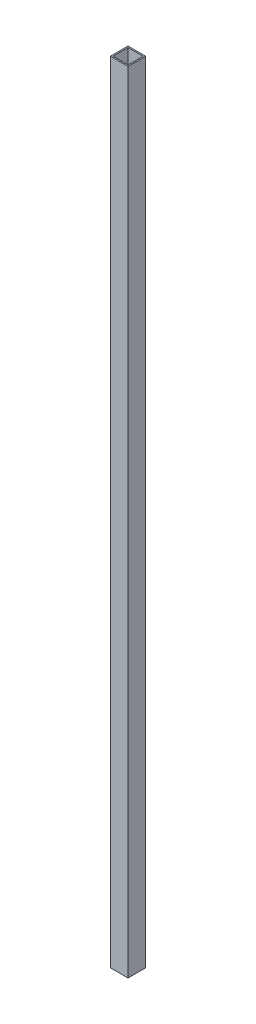
ISO-10303-21;
HEADER;
FILE_DESCRIPTION(('STEP AP214'),'2;1');
FILE_NAME('part.step','',(''),(''),'','','');
FILE_SCHEMA(('AUTOMOTIVE_DESIGN { 1 0 10303 214 1 1 1 1 }'));
ENDSEC;
DATA;
#1=APPLICATION_CONTEXT('core data for automotive mechanical design processes');
#2=APPLICATION_PROTOCOL_DEFINITION('international standard','automotive_design',2000,#1);
#3=PRODUCT_CONTEXT('',#1,'mechanical');
#4=PRODUCT('Part','Part','',(#3));
#5=PRODUCT_RELATED_PRODUCT_CATEGORY('part','',(#4));
#6=PRODUCT_DEFINITION_FORMATION('','',#4);
#7=PRODUCT_DEFINITION_CONTEXT('part definition',#1,'design');
#8=PRODUCT_DEFINITION('design','',#6,#7);
#9=PRODUCT_DEFINITION_SHAPE('','',#8);
#10=(LENGTH_UNIT() NAMED_UNIT(*) SI_UNIT(.MILLI.,.METRE.));
#11=(NAMED_UNIT(*) PLANE_ANGLE_UNIT() SI_UNIT($,.RADIAN.));
#12=(NAMED_UNIT(*) SI_UNIT($,.STERADIAN.) SOLID_ANGLE_UNIT());
#13=UNCERTAINTY_MEASURE_WITH_UNIT(LENGTH_MEASURE(1.E-05),#10,'distance_accuracy_value','');
#14=(GEOMETRIC_REPRESENTATION_CONTEXT(3) GLOBAL_UNCERTAINTY_ASSIGNED_CONTEXT((#13)) GLOBAL_UNIT_ASSIGNED_CONTEXT((#10,
#11,#12)) REPRESENTATION_CONTEXT('',''));
#15=CARTESIAN_POINT('',(0.,0.,0.));
#16=DIRECTION('',(0.,0.,1.));
#17=DIRECTION('',(1.,0.,0.));
#18=AXIS2_PLACEMENT_3D('',#15,#16,#17);
#19=CARTESIAN_POINT('',(0.,1985.9625,0.));
#20=DIRECTION('',(0.,-1.,0.));
#21=DIRECTION('',(0.,0.,-1.));
#22=AXIS2_PLACEMENT_3D('',#19,#20,#21);
#23=PLANE('',#22);
#24=DIRECTION('',(0.,0.,1.));
#25=VECTOR('',#24,1.);
#26=CARTESIAN_POINT('',(0.,1985.9625,0.));
#27=LINE('',#26,#25);
#28=CARTESIAN_POINT('',(0.,1985.9625,-44.45));
#29=VERTEX_POINT('',#28);
#30=CARTESIAN_POINT('',(0.,1985.9625,0.));
#31=VERTEX_POINT('',#30);
#32=EDGE_CURVE('E133',#29,#31,#27,.T.);
#33=ORIENTED_EDGE('',*,*,#32,.T.);
#34=DIRECTION('',(1.,0.,0.));
#35=VECTOR('',#34,1.);
#36=CARTESIAN_POINT('',(0.,1985.9625,0.));
#37=LINE('',#36,#35);
#38=CARTESIAN_POINT('',(44.45,1985.9625,0.));
#39=VERTEX_POINT('',#38);
#40=EDGE_CURVE('E136',#31,#39,#37,.T.);
#41=ORIENTED_EDGE('',*,*,#40,.T.);
#42=DIRECTION('',(0.,0.,-1.));
#43=VECTOR('',#42,1.);
#44=CARTESIAN_POINT('',(44.45,1985.9625,0.));
#45=LINE('',#44,#43);
#46=CARTESIAN_POINT('',(44.45,1985.9625,-44.45));
#47=VERTEX_POINT('',#46);
#48=EDGE_CURVE('E139',#39,#47,#45,.T.);
#49=ORIENTED_EDGE('',*,*,#48,.T.);
#50=DIRECTION('',(-1.,0.,0.));
#51=VECTOR('',#50,1.);
#52=CARTESIAN_POINT('',(0.,1985.9625,-44.45));
#53=LINE('',#52,#51);
#54=EDGE_CURVE('E141',#47,#29,#53,.T.);
#55=ORIENTED_EDGE('',*,*,#54,.T.);
#56=EDGE_LOOP('',(#33,#41,#49,#55));
#57=FACE_BOUND('',#56,.T.);
#58=DIRECTION('',(1.,0.,0.));
#59=VECTOR('',#58,1.);
#60=CARTESIAN_POINT('',(3.175,1985.9625,-3.175));
#61=LINE('',#60,#59);
#62=CARTESIAN_POINT('',(3.175,1985.9625,-3.175));
#63=VERTEX_POINT('',#62);
#64=CARTESIAN_POINT('',(41.275,1985.9625,-3.175));
#65=VERTEX_POINT('',#64);
#66=EDGE_CURVE('E97',#63,#65,#61,.T.);
#67=ORIENTED_EDGE('',*,*,#66,.F.);
#68=DIRECTION('',(0.,0.,1.));
#69=VECTOR('',#68,1.);
#70=CARTESIAN_POINT('',(3.175,1985.9625,-3.175));
#71=LINE('',#70,#69);
#72=CARTESIAN_POINT('',(3.175,1985.9625,-41.275));
#73=VERTEX_POINT('',#72);
#74=EDGE_CURVE('E119',#73,#63,#71,.T.);
#75=ORIENTED_EDGE('',*,*,#74,.F.);
#76=DIRECTION('',(-1.,0.,0.));
#77=VECTOR('',#76,1.);
#78=CARTESIAN_POINT('',(3.175,1985.9625,-41.275));
#79=LINE('',#78,#77);
#80=CARTESIAN_POINT('',(41.275,1985.9625,-41.275));
#81=VERTEX_POINT('',#80);
#82=EDGE_CURVE('E117',#81,#73,#79,.T.);
#83=ORIENTED_EDGE('',*,*,#82,.F.);
#84=DIRECTION('',(0.,0.,-1.));
#85=VECTOR('',#84,1.);
#86=CARTESIAN_POINT('',(41.275,1985.9625,-3.175));
#87=LINE('',#86,#85);
#88=EDGE_CURVE('E105',#65,#81,#87,.T.);
#89=ORIENTED_EDGE('',*,*,#88,.F.);
#90=EDGE_LOOP('',(#67,#75,#83,#89));
#91=FACE_BOUND('',#90,.T.);
#92=ADVANCED_FACE('F32',(#57,#91),#23,.F.);
#93=CARTESIAN_POINT('',(0.,0.,0.));
#94=DIRECTION('',(0.,-1.,0.));
#95=DIRECTION('',(0.,0.,-1.));
#96=AXIS2_PLACEMENT_3D('',#93,#94,#95);
#97=PLANE('',#96);
#98=DIRECTION('',(0.,0.,1.));
#99=VECTOR('',#98,1.);
#100=CARTESIAN_POINT('',(0.,0.,0.));
#101=LINE('',#100,#99);
#102=CARTESIAN_POINT('',(0.,0.,-44.45));
#103=VERTEX_POINT('',#102);
#104=CARTESIAN_POINT('',(0.,0.,0.));
#105=VERTEX_POINT('',#104);
#106=EDGE_CURVE('E113',#103,#105,#101,.T.);
#107=ORIENTED_EDGE('',*,*,#106,.F.);
#108=DIRECTION('',(-1.,0.,0.));
#109=VECTOR('',#108,1.);
#110=CARTESIAN_POINT('',(0.,0.,-44.45));
#111=LINE('',#110,#109);
#112=CARTESIAN_POINT('',(44.45,0.,-44.45));
#113=VERTEX_POINT('',#112);
#114=EDGE_CURVE('E137',#113,#103,#111,.T.);
#115=ORIENTED_EDGE('',*,*,#114,.F.);
#116=DIRECTION('',(0.,0.,-1.));
#117=VECTOR('',#116,1.);
#118=CARTESIAN_POINT('',(44.45,0.,0.));
#119=LINE('',#118,#117);
#120=CARTESIAN_POINT('',(44.45,0.,0.));
#121=VERTEX_POINT('',#120);
#122=EDGE_CURVE('E148',#121,#113,#119,.T.);
#123=ORIENTED_EDGE('',*,*,#122,.F.);
#124=DIRECTION('',(1.,0.,0.));
#125=VECTOR('',#124,1.);
#126=CARTESIAN_POINT('',(0.,0.,0.));
#127=LINE('',#126,#125);
#128=EDGE_CURVE('E146',#105,#121,#127,.T.);
#129=ORIENTED_EDGE('',*,*,#128,.F.);
#130=EDGE_LOOP('',(#107,#115,#123,#129));
#131=FACE_BOUND('',#130,.T.);
#132=DIRECTION('',(0.,0.,1.));
#133=VECTOR('',#132,1.);
#134=CARTESIAN_POINT('',(3.175,0.,-3.175));
#135=LINE('',#134,#133);
#136=CARTESIAN_POINT('',(3.175,0.,-41.275));
#137=VERTEX_POINT('',#136);
#138=CARTESIAN_POINT('',(3.175,0.,-3.175));
#139=VERTEX_POINT('',#138);
#140=EDGE_CURVE('E106',#137,#139,#135,.T.);
#141=ORIENTED_EDGE('',*,*,#140,.T.);
#142=DIRECTION('',(1.,0.,0.));
#143=VECTOR('',#142,1.);
#144=CARTESIAN_POINT('',(3.175,0.,-3.175));
#145=LINE('',#144,#143);
#146=CARTESIAN_POINT('',(41.275,0.,-3.175));
#147=VERTEX_POINT('',#146);
#148=EDGE_CURVE('E55',#139,#147,#145,.T.);
#149=ORIENTED_EDGE('',*,*,#148,.T.);
#150=DIRECTION('',(0.,0.,-1.));
#151=VECTOR('',#150,1.);
#152=CARTESIAN_POINT('',(41.275,0.,-3.175));
#153=LINE('',#152,#151);
#154=CARTESIAN_POINT('',(41.275,0.,-41.275));
#155=VERTEX_POINT('',#154);
#156=EDGE_CURVE('E112',#147,#155,#153,.T.);
#157=ORIENTED_EDGE('',*,*,#156,.T.);
#158=DIRECTION('',(-1.,0.,0.));
#159=VECTOR('',#158,1.);
#160=CARTESIAN_POINT('',(3.175,0.,-41.275));
#161=LINE('',#160,#159);
#162=EDGE_CURVE('E125',#155,#137,#161,.T.);
#163=ORIENTED_EDGE('',*,*,#162,.T.);
#164=EDGE_LOOP('',(#141,#149,#157,#163));
#165=FACE_BOUND('',#164,.T.);
#166=ADVANCED_FACE('F166',(#131,#165),#97,.T.);
#167=CARTESIAN_POINT('',(0.,1985.9625,0.));
#168=DIRECTION('',(1.,0.,0.));
#169=DIRECTION('',(0.,0.,-1.));
#170=AXIS2_PLACEMENT_3D('',#167,#168,#169);
#171=PLANE('',#170);
#172=ORIENTED_EDGE('',*,*,#106,.T.);
#173=DIRECTION('',(0.,-1.,0.));
#174=VECTOR('',#173,1.);
#175=CARTESIAN_POINT('',(0.,1985.9625,0.));
#176=LINE('',#175,#174);
#177=EDGE_CURVE('E11',#31,#105,#176,.T.);
#178=ORIENTED_EDGE('',*,*,#177,.F.);
#179=ORIENTED_EDGE('',*,*,#32,.F.);
#180=DIRECTION('',(0.,-1.,0.));
#181=VECTOR('',#180,1.);
#182=CARTESIAN_POINT('',(0.,1985.9625,-44.45));
#183=LINE('',#182,#181);
#184=EDGE_CURVE('E143',#29,#103,#183,.T.);
#185=ORIENTED_EDGE('',*,*,#184,.T.);
#186=EDGE_LOOP('',(#172,#178,#179,#185));
#187=FACE_BOUND('',#186,.T.);
#188=ADVANCED_FACE('F34',(#187),#171,.F.);
#189=CARTESIAN_POINT('',(0.,1985.9625,0.));
#190=DIRECTION('',(0.,0.,-1.));
#191=DIRECTION('',(-1.,0.,0.));
#192=AXIS2_PLACEMENT_3D('',#189,#190,#191);
#193=PLANE('',#192);
#194=ORIENTED_EDGE('',*,*,#128,.T.);
#195=DIRECTION('',(0.,-1.,0.));
#196=VECTOR('',#195,1.);
#197=CARTESIAN_POINT('',(44.45,1985.9625,0.));
#198=LINE('',#197,#196);
#199=EDGE_CURVE('E40',#39,#121,#198,.T.);
#200=ORIENTED_EDGE('',*,*,#199,.F.);
#201=ORIENTED_EDGE('',*,*,#40,.F.);
#202=ORIENTED_EDGE('',*,*,#177,.T.);
#203=EDGE_LOOP('',(#194,#200,#201,#202));
#204=FACE_BOUND('',#203,.T.);
#205=ADVANCED_FACE('F176',(#204),#193,.F.);
#206=CARTESIAN_POINT('',(44.45,1985.9625,0.));
#207=DIRECTION('',(-1.,0.,0.));
#208=DIRECTION('',(0.,0.,1.));
#209=AXIS2_PLACEMENT_3D('',#206,#207,#208);
#210=PLANE('',#209);
#211=ORIENTED_EDGE('',*,*,#122,.T.);
#212=DIRECTION('',(0.,-1.,0.));
#213=VECTOR('',#212,1.);
#214=CARTESIAN_POINT('',(44.45,1985.9625,-44.45));
#215=LINE('',#214,#213);
#216=EDGE_CURVE('E153',#47,#113,#215,.T.);
#217=ORIENTED_EDGE('',*,*,#216,.F.);
#218=ORIENTED_EDGE('',*,*,#48,.F.);
#219=ORIENTED_EDGE('',*,*,#199,.T.);
#220=EDGE_LOOP('',(#211,#217,#218,#219));
#221=FACE_BOUND('',#220,.T.);
#222=ADVANCED_FACE('F160',(#221),#210,.F.);
#223=CARTESIAN_POINT('',(0.,1985.9625,-44.45));
#224=DIRECTION('',(0.,0.,1.));
#225=DIRECTION('',(1.,0.,0.));
#226=AXIS2_PLACEMENT_3D('',#223,#224,#225);
#227=PLANE('',#226);
#228=ORIENTED_EDGE('',*,*,#114,.T.);
#229=ORIENTED_EDGE('',*,*,#184,.F.);
#230=ORIENTED_EDGE('',*,*,#54,.F.);
#231=ORIENTED_EDGE('',*,*,#216,.T.);
#232=EDGE_LOOP('',(#228,#229,#230,#231));
#233=FACE_BOUND('',#232,.T.);
#234=ADVANCED_FACE('F170',(#233),#227,.F.);
#235=CARTESIAN_POINT('',(3.175,1985.9625,-3.175));
#236=DIRECTION('',(0.,0.,-1.));
#237=DIRECTION('',(-1.,0.,0.));
#238=AXIS2_PLACEMENT_3D('',#235,#236,#237);
#239=PLANE('',#238);
#240=ORIENTED_EDGE('',*,*,#148,.F.);
#241=DIRECTION('',(0.,-1.,0.));
#242=VECTOR('',#241,1.);
#243=CARTESIAN_POINT('',(3.175,1985.9625,-3.175));
#244=LINE('',#243,#242);
#245=EDGE_CURVE('E101',#63,#139,#244,.T.);
#246=ORIENTED_EDGE('',*,*,#245,.F.);
#247=ORIENTED_EDGE('',*,*,#66,.T.);
#248=DIRECTION('',(0.,-1.,0.));
#249=VECTOR('',#248,1.);
#250=CARTESIAN_POINT('',(41.275,1985.9625,-3.175));
#251=LINE('',#250,#249);
#252=EDGE_CURVE('E100',#65,#147,#251,.T.);
#253=ORIENTED_EDGE('',*,*,#252,.T.);
#254=EDGE_LOOP('',(#240,#246,#247,#253));
#255=FACE_BOUND('',#254,.T.);
#256=ADVANCED_FACE('F99',(#255),#239,.T.);
#257=CARTESIAN_POINT('',(41.275,1985.9625,-3.175));
#258=DIRECTION('',(-1.,0.,0.));
#259=DIRECTION('',(0.,0.,1.));
#260=AXIS2_PLACEMENT_3D('',#257,#258,#259);
#261=PLANE('',#260);
#262=ORIENTED_EDGE('',*,*,#156,.F.);
#263=ORIENTED_EDGE('',*,*,#252,.F.);
#264=ORIENTED_EDGE('',*,*,#88,.T.);
#265=DIRECTION('',(0.,-1.,0.));
#266=VECTOR('',#265,1.);
#267=CARTESIAN_POINT('',(41.275,1985.9625,-41.275));
#268=LINE('',#267,#266);
#269=EDGE_CURVE('E114',#81,#155,#268,.T.);
#270=ORIENTED_EDGE('',*,*,#269,.T.);
#271=EDGE_LOOP('',(#262,#263,#264,#270));
#272=FACE_BOUND('',#271,.T.);
#273=ADVANCED_FACE('F109',(#272),#261,.T.);
#274=CARTESIAN_POINT('',(3.175,1985.9625,-41.275));
#275=DIRECTION('',(0.,0.,1.));
#276=DIRECTION('',(1.,0.,0.));
#277=AXIS2_PLACEMENT_3D('',#274,#275,#276);
#278=PLANE('',#277);
#279=ORIENTED_EDGE('',*,*,#162,.F.);
#280=ORIENTED_EDGE('',*,*,#269,.F.);
#281=ORIENTED_EDGE('',*,*,#82,.T.);
#282=DIRECTION('',(0.,-1.,0.));
#283=VECTOR('',#282,1.);
#284=CARTESIAN_POINT('',(3.175,1985.9625,-41.275));
#285=LINE('',#284,#283);
#286=EDGE_CURVE('E47',#73,#137,#285,.T.);
#287=ORIENTED_EDGE('',*,*,#286,.T.);
#288=EDGE_LOOP('',(#279,#280,#281,#287));
#289=FACE_BOUND('',#288,.T.);
#290=ADVANCED_FACE('F199',(#289),#278,.T.);
#291=CARTESIAN_POINT('',(3.175,1985.9625,-3.175));
#292=DIRECTION('',(1.,0.,0.));
#293=DIRECTION('',(0.,0.,-1.));
#294=AXIS2_PLACEMENT_3D('',#291,#292,#293);
#295=PLANE('',#294);
#296=ORIENTED_EDGE('',*,*,#140,.F.);
#297=ORIENTED_EDGE('',*,*,#286,.F.);
#298=ORIENTED_EDGE('',*,*,#74,.T.);
#299=ORIENTED_EDGE('',*,*,#245,.T.);
#300=EDGE_LOOP('',(#296,#297,#298,#299));
#301=FACE_BOUND('',#300,.T.);
#302=ADVANCED_FACE('F203',(#301),#295,.T.);
#303=CLOSED_SHELL('',(#92,#166,#188,#205,#222,#234,#256,#273,#290,#302));
#304=MANIFOLD_SOLID_BREP('B2',#303);
#305=ADVANCED_BREP_SHAPE_REPRESENTATION('',(#18,#304),#14);
#306=SHAPE_DEFINITION_REPRESENTATION(#9,#305);
ENDSEC;
END-ISO-10303-21;
